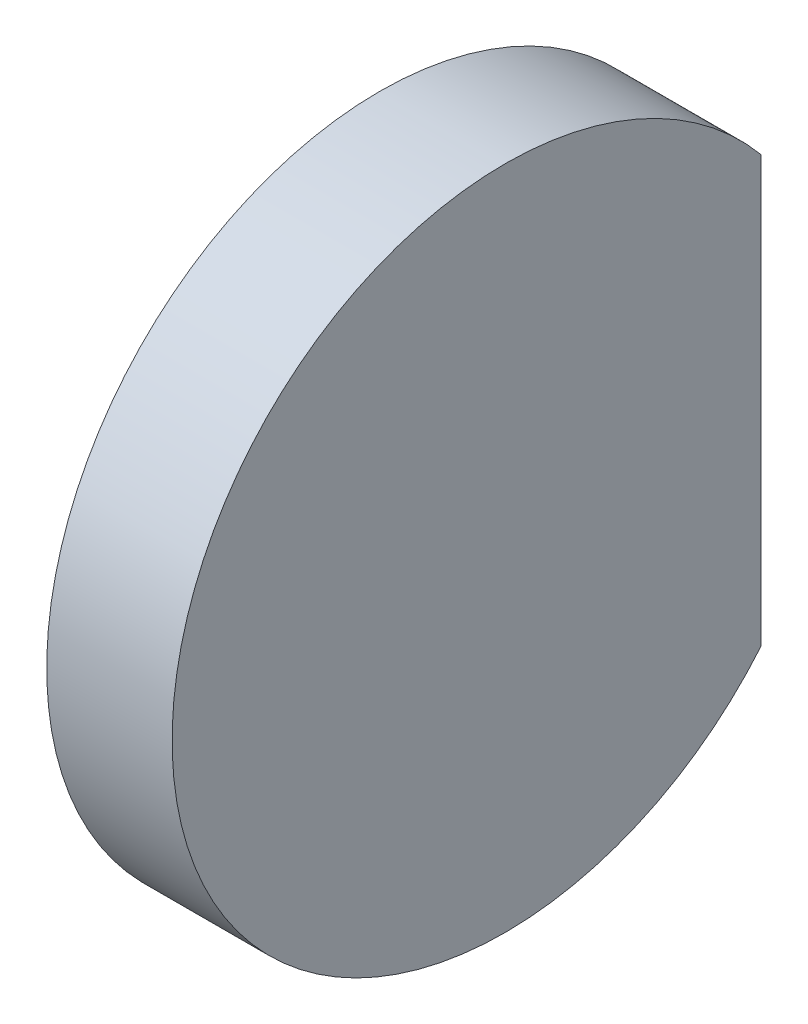
ISO-10303-21;
HEADER;
FILE_DESCRIPTION(('STEP AP214'),'2;1');
FILE_NAME('part.step','',(''),(''),'','','');
FILE_SCHEMA(('AUTOMOTIVE_DESIGN { 1 0 10303 214 1 1 1 1 }'));
ENDSEC;
DATA;
#1=APPLICATION_CONTEXT('core data for automotive mechanical design processes');
#2=APPLICATION_PROTOCOL_DEFINITION('international standard','automotive_design',2000,#1);
#3=PRODUCT_CONTEXT('',#1,'mechanical');
#4=PRODUCT('Part','Part','',(#3));
#5=PRODUCT_RELATED_PRODUCT_CATEGORY('part','',(#4));
#6=PRODUCT_DEFINITION_FORMATION('','',#4);
#7=PRODUCT_DEFINITION_CONTEXT('part definition',#1,'design');
#8=PRODUCT_DEFINITION('design','',#6,#7);
#9=PRODUCT_DEFINITION_SHAPE('','',#8);
#10=(LENGTH_UNIT() NAMED_UNIT(*) SI_UNIT(.MILLI.,.METRE.));
#11=(NAMED_UNIT(*) PLANE_ANGLE_UNIT() SI_UNIT($,.RADIAN.));
#12=(NAMED_UNIT(*) SI_UNIT($,.STERADIAN.) SOLID_ANGLE_UNIT());
#13=UNCERTAINTY_MEASURE_WITH_UNIT(LENGTH_MEASURE(1.E-05),#10,'distance_accuracy_value','');
#14=(GEOMETRIC_REPRESENTATION_CONTEXT(3) GLOBAL_UNCERTAINTY_ASSIGNED_CONTEXT((#13)) GLOBAL_UNIT_ASSIGNED_CONTEXT((#10,
#11,#12)) REPRESENTATION_CONTEXT('',''));
#15=CARTESIAN_POINT('',(0.,0.,0.));
#16=DIRECTION('',(0.,0.,1.));
#17=DIRECTION('',(1.,0.,0.));
#18=AXIS2_PLACEMENT_3D('',#15,#16,#17);
#19=CARTESIAN_POINT('',(38.55,0.,0.));
#20=DIRECTION('',(-1.,0.,0.));
#21=DIRECTION('',(0.,1.,0.));
#22=AXIS2_PLACEMENT_3D('',#19,#20,#21);
#23=SPHERICAL_SURFACE('',#22,38.55);
#24=CARTESIAN_POINT('',(0.551940839037583,0.,0.));
#25=DIRECTION('',(-1.,0.,0.));
#26=DIRECTION('',(0.,0.,1.));
#27=AXIS2_PLACEMENT_3D('',#24,#25,#26);
#28=CIRCLE('',#27,6.5);
#29=CARTESIAN_POINT('',(0.551940839037583,-4.15331193145902,-5.00000000000001));
#30=VERTEX_POINT('',#29);
#31=CARTESIAN_POINT('',(0.551940839037583,4.15331193145902,-5.00000000000001));
#32=VERTEX_POINT('',#31);
#33=EDGE_CURVE('E11',#30,#32,#28,.T.);
#34=ORIENTED_EDGE('',*,*,#33,.T.);
#35=CARTESIAN_POINT('',(38.55,0.,-5.00000000000001));
#36=DIRECTION('',(0.,0.,1.));
#37=DIRECTION('',(0.,-1.,0.));
#38=AXIS2_PLACEMENT_3D('',#35,#36,#37);
#39=CIRCLE('',#38,38.2243704984137);
#40=EDGE_CURVE('E64',#32,#30,#39,.T.);
#41=ORIENTED_EDGE('',*,*,#40,.T.);
#42=EDGE_LOOP('',(#34,#41));
#43=FACE_BOUND('',#42,.T.);
#44=ADVANCED_FACE('F31',(#43),#23,.T.);
#45=CARTESIAN_POINT('',(0.,0.,0.));
#46=DIRECTION('',(-1.,0.,0.));
#47=DIRECTION('',(0.,0.,1.));
#48=AXIS2_PLACEMENT_3D('',#45,#46,#47);
#49=CYLINDRICAL_SURFACE('',#48,6.5);
#50=CARTESIAN_POINT('',(3.,0.,0.));
#51=DIRECTION('',(-1.,0.,0.));
#52=DIRECTION('',(0.,0.,1.));
#53=AXIS2_PLACEMENT_3D('',#50,#51,#52);
#54=CIRCLE('',#53,6.5);
#55=CARTESIAN_POINT('',(3.,-4.15331193145902,-5.00000000000001));
#56=VERTEX_POINT('',#55);
#57=CARTESIAN_POINT('',(3.,4.15331193145902,-5.00000000000001));
#58=VERTEX_POINT('',#57);
#59=EDGE_CURVE('E38',#56,#58,#54,.T.);
#60=ORIENTED_EDGE('',*,*,#59,.T.);
#61=DIRECTION('',(1.,0.,0.));
#62=VECTOR('',#61,1.);
#63=CARTESIAN_POINT('',(0.,4.15331193145902,-5.00000000000001));
#64=LINE('',#63,#62);
#65=EDGE_CURVE('E45',#32,#58,#64,.T.);
#66=ORIENTED_EDGE('',*,*,#65,.F.);
#67=ORIENTED_EDGE('',*,*,#33,.F.);
#68=DIRECTION('',(1.,0.,0.));
#69=VECTOR('',#68,1.);
#70=CARTESIAN_POINT('',(0.,-4.15331193145902,-5.00000000000001));
#71=LINE('',#70,#69);
#72=EDGE_CURVE('E50',#30,#56,#71,.T.);
#73=ORIENTED_EDGE('',*,*,#72,.T.);
#74=EDGE_LOOP('',(#60,#66,#67,#73));
#75=FACE_BOUND('',#74,.T.);
#76=ADVANCED_FACE('F63',(#75),#49,.T.);
#77=CARTESIAN_POINT('',(3.,6.5,0.));
#78=DIRECTION('',(-1.,0.,0.));
#79=DIRECTION('',(0.,0.,1.));
#80=AXIS2_PLACEMENT_3D('',#77,#78,#79);
#81=PLANE('',#80);
#82=ORIENTED_EDGE('',*,*,#59,.F.);
#83=DIRECTION('',(0.,-1.,0.));
#84=VECTOR('',#83,1.);
#85=CARTESIAN_POINT('',(3.,0.,-5.00000000000001));
#86=LINE('',#85,#84);
#87=EDGE_CURVE('E55',#58,#56,#86,.T.);
#88=ORIENTED_EDGE('',*,*,#87,.F.);
#89=EDGE_LOOP('',(#82,#88));
#90=FACE_BOUND('',#89,.T.);
#91=ADVANCED_FACE('F66',(#90),#81,.F.);
#92=CARTESIAN_POINT('',(0.,0.,-5.00000000000001));
#93=DIRECTION('',(0.,0.,1.));
#94=DIRECTION('',(0.,-1.,0.));
#95=AXIS2_PLACEMENT_3D('',#92,#93,#94);
#96=PLANE('',#95);
#97=ORIENTED_EDGE('',*,*,#65,.T.);
#98=ORIENTED_EDGE('',*,*,#87,.T.);
#99=ORIENTED_EDGE('',*,*,#72,.F.);
#100=ORIENTED_EDGE('',*,*,#40,.F.);
#101=EDGE_LOOP('',(#97,#98,#99,#100));
#102=FACE_BOUND('',#101,.T.);
#103=ADVANCED_FACE('F56',(#102),#96,.F.);
#104=CLOSED_SHELL('',(#44,#76,#91,#103));
#105=MANIFOLD_SOLID_BREP('B2',#104);
#106=ADVANCED_BREP_SHAPE_REPRESENTATION('',(#18,#105),#14);
#107=SHAPE_DEFINITION_REPRESENTATION(#9,#106);
ENDSEC;
END-ISO-10303-21;
